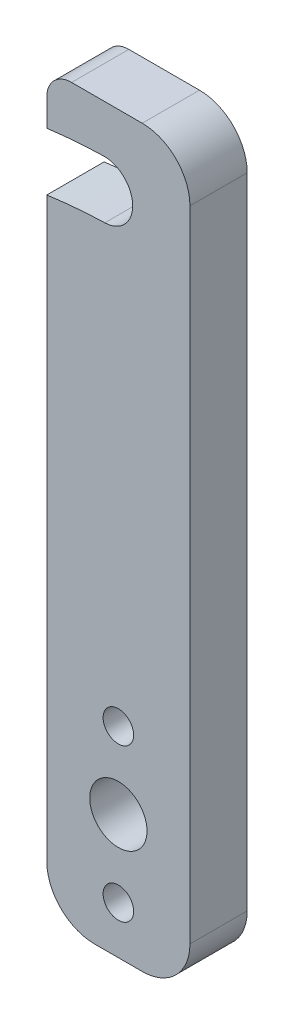
ISO-10303-21;
HEADER;
FILE_DESCRIPTION(('STEP AP214'),'2;1');
FILE_NAME('part.step','',(''),(''),'','','');
FILE_SCHEMA(('AUTOMOTIVE_DESIGN { 1 0 10303 214 1 1 1 1 }'));
ENDSEC;
DATA;
#1=APPLICATION_CONTEXT('core data for automotive mechanical design processes');
#2=APPLICATION_PROTOCOL_DEFINITION('international standard','automotive_design',2000,#1);
#3=PRODUCT_CONTEXT('',#1,'mechanical');
#4=PRODUCT('Part','Part','',(#3));
#5=PRODUCT_RELATED_PRODUCT_CATEGORY('part','',(#4));
#6=PRODUCT_DEFINITION_FORMATION('','',#4);
#7=PRODUCT_DEFINITION_CONTEXT('part definition',#1,'design');
#8=PRODUCT_DEFINITION('design','',#6,#7);
#9=PRODUCT_DEFINITION_SHAPE('','',#8);
#10=(LENGTH_UNIT() NAMED_UNIT(*) SI_UNIT(.MILLI.,.METRE.));
#11=(NAMED_UNIT(*) PLANE_ANGLE_UNIT() SI_UNIT($,.RADIAN.));
#12=(NAMED_UNIT(*) SI_UNIT($,.STERADIAN.) SOLID_ANGLE_UNIT());
#13=UNCERTAINTY_MEASURE_WITH_UNIT(LENGTH_MEASURE(1.E-05),#10,'distance_accuracy_value','');
#14=(GEOMETRIC_REPRESENTATION_CONTEXT(3) GLOBAL_UNCERTAINTY_ASSIGNED_CONTEXT((#13)) GLOBAL_UNIT_ASSIGNED_CONTEXT((#10,
#11,#12)) REPRESENTATION_CONTEXT('',''));
#15=CARTESIAN_POINT('',(0.,0.,0.));
#16=DIRECTION('',(0.,0.,1.));
#17=DIRECTION('',(1.,0.,0.));
#18=AXIS2_PLACEMENT_3D('',#15,#16,#17);
#19=CARTESIAN_POINT('',(-1.49892513753061,30.4905053815204,6.));
#20=DIRECTION('',(0.,0.,-1.));
#21=DIRECTION('',(-1.,0.,0.));
#22=AXIS2_PLACEMENT_3D('',#19,#20,#21);
#23=CYLINDRICAL_SURFACE('',#22,3.);
#24=CARTESIAN_POINT('',(-1.49892513753061,30.4905053815204,0.));
#25=DIRECTION('',(0.,0.,1.));
#26=DIRECTION('',(1.,0.,0.));
#27=AXIS2_PLACEMENT_3D('',#24,#25,#26);
#28=CIRCLE('',#27,3.);
#29=CARTESIAN_POINT('',(-1.41862557659147,27.4915802439898,0.));
#30=VERTEX_POINT('',#29);
#31=CARTESIAN_POINT('',(-1.57922469846975,33.489430519051,0.));
#32=VERTEX_POINT('',#31);
#33=EDGE_CURVE('E135',#30,#32,#28,.T.);
#34=ORIENTED_EDGE('',*,*,#33,.F.);
#35=DIRECTION('',(0.,0.,-1.));
#36=VECTOR('',#35,1.);
#37=CARTESIAN_POINT('',(-1.41862557659147,27.4915802439898,6.));
#38=LINE('',#37,#36);
#39=CARTESIAN_POINT('',(-1.41862557659147,27.4915802439898,6.));
#40=VERTEX_POINT('',#39);
#41=EDGE_CURVE('E129',#40,#30,#38,.T.);
#42=ORIENTED_EDGE('',*,*,#41,.F.);
#43=CARTESIAN_POINT('',(-1.49892513753061,30.4905053815204,6.));
#44=DIRECTION('',(0.,0.,1.));
#45=DIRECTION('',(1.,0.,0.));
#46=AXIS2_PLACEMENT_3D('',#43,#44,#45);
#47=CIRCLE('',#46,3.);
#48=CARTESIAN_POINT('',(-1.57922469846975,33.489430519051,6.));
#49=VERTEX_POINT('',#48);
#50=EDGE_CURVE('E132',#40,#49,#47,.T.);
#51=ORIENTED_EDGE('',*,*,#50,.T.);
#52=DIRECTION('',(0.,0.,-1.));
#53=VECTOR('',#52,1.);
#54=CARTESIAN_POINT('',(-1.57922469846975,33.489430519051,6.));
#55=LINE('',#54,#53);
#56=EDGE_CURVE('E439',#49,#32,#55,.T.);
#57=ORIENTED_EDGE('',*,*,#56,.T.);
#58=EDGE_LOOP('',(#34,#42,#51,#57));
#59=FACE_BOUND('',#58,.T.);
#60=ADVANCED_FACE('F40',(#59),#23,.F.);
#61=CARTESIAN_POINT('',(0.,-25.489430519051,6.));
#62=DIRECTION('',(0.,0.,-1.));
#63=DIRECTION('',(-1.,0.,0.));
#64=AXIS2_PLACEMENT_3D('',#61,#62,#63);
#65=CYLINDRICAL_SURFACE('',#64,53.);
#66=CARTESIAN_POINT('',(0.,-25.489430519051,0.));
#67=DIRECTION('',(0.,0.,1.));
#68=DIRECTION('',(1.,0.,0.));
#69=AXIS2_PLACEMENT_3D('',#66,#67,#68);
#70=CIRCLE('',#69,53.);
#71=CARTESIAN_POINT('',(-7.5,26.977225558881,0.));
#72=VERTEX_POINT('',#71);
#73=EDGE_CURVE('E257',#30,#72,#70,.T.);
#74=ORIENTED_EDGE('',*,*,#73,.T.);
#75=DIRECTION('',(0.,0.,-1.));
#76=VECTOR('',#75,1.);
#77=CARTESIAN_POINT('',(-7.5,26.977225558881,6.));
#78=LINE('',#77,#76);
#79=CARTESIAN_POINT('',(-7.5,26.977225558881,6.));
#80=VERTEX_POINT('',#79);
#81=EDGE_CURVE('E140',#80,#72,#78,.T.);
#82=ORIENTED_EDGE('',*,*,#81,.F.);
#83=CARTESIAN_POINT('',(0.,-25.489430519051,6.));
#84=DIRECTION('',(0.,0.,1.));
#85=DIRECTION('',(1.,0.,0.));
#86=AXIS2_PLACEMENT_3D('',#83,#84,#85);
#87=CIRCLE('',#86,53.);
#88=EDGE_CURVE('E144',#40,#80,#87,.T.);
#89=ORIENTED_EDGE('',*,*,#88,.F.);
#90=ORIENTED_EDGE('',*,*,#41,.T.);
#91=EDGE_LOOP('',(#74,#82,#89,#90));
#92=FACE_BOUND('',#91,.T.);
#93=ADVANCED_FACE('F145',(#92),#65,.T.);
#94=CARTESIAN_POINT('',(-7.5,0.,6.));
#95=DIRECTION('',(-1.,0.,0.));
#96=DIRECTION('',(0.,-1.,0.));
#97=AXIS2_PLACEMENT_3D('',#94,#95,#96);
#98=PLANE('',#97);
#99=DIRECTION('',(0.,1.,0.));
#100=VECTOR('',#99,1.);
#101=CARTESIAN_POINT('',(-7.5,0.,0.));
#102=LINE('',#101,#100);
#103=CARTESIAN_POINT('',(-7.5,-33.489430519051,0.));
#104=VERTEX_POINT('',#103);
#105=EDGE_CURVE('E249',#104,#72,#102,.T.);
#106=ORIENTED_EDGE('',*,*,#105,.F.);
#107=DIRECTION('',(0.,0.,-1.));
#108=VECTOR('',#107,1.);
#109=CARTESIAN_POINT('',(-7.5,-33.489430519051,6.));
#110=LINE('',#109,#108);
#111=CARTESIAN_POINT('',(-7.5,-33.489430519051,6.));
#112=VERTEX_POINT('',#111);
#113=EDGE_CURVE('E215',#104,#112,#110,.F.);
#114=ORIENTED_EDGE('',*,*,#113,.T.);
#115=DIRECTION('',(0.,1.,0.));
#116=VECTOR('',#115,1.);
#117=CARTESIAN_POINT('',(-7.5,0.,6.));
#118=LINE('',#117,#116);
#119=EDGE_CURVE('E150',#112,#80,#118,.T.);
#120=ORIENTED_EDGE('',*,*,#119,.T.);
#121=ORIENTED_EDGE('',*,*,#81,.T.);
#122=EDGE_LOOP('',(#106,#114,#120,#121));
#123=FACE_BOUND('',#122,.T.);
#124=ADVANCED_FACE('F287',(#123),#98,.T.);
#125=CARTESIAN_POINT('',(0.,-38.489430519051,6.));
#126=DIRECTION('',(0.,1.,0.));
#127=DIRECTION('',(0.,0.,1.));
#128=AXIS2_PLACEMENT_3D('',#125,#126,#127);
#129=PLANE('',#128);
#130=DIRECTION('',(1.,0.,0.));
#131=VECTOR('',#130,1.);
#132=CARTESIAN_POINT('',(0.,-38.489430519051,6.));
#133=LINE('',#132,#131);
#134=CARTESIAN_POINT('',(-2.5,-38.489430519051,6.));
#135=VERTEX_POINT('',#134);
#136=CARTESIAN_POINT('',(2.5,-38.489430519051,6.));
#137=VERTEX_POINT('',#136);
#138=EDGE_CURVE('E181',#135,#137,#133,.T.);
#139=ORIENTED_EDGE('',*,*,#138,.F.);
#140=DIRECTION('',(0.,0.,-1.));
#141=VECTOR('',#140,1.);
#142=CARTESIAN_POINT('',(-2.5,-38.489430519051,0.));
#143=LINE('',#142,#141);
#144=CARTESIAN_POINT('',(-2.5,-38.489430519051,0.));
#145=VERTEX_POINT('',#144);
#146=EDGE_CURVE('E433',#135,#145,#143,.T.);
#147=ORIENTED_EDGE('',*,*,#146,.T.);
#148=DIRECTION('',(1.,0.,0.));
#149=VECTOR('',#148,1.);
#150=CARTESIAN_POINT('',(0.,-38.489430519051,0.));
#151=LINE('',#150,#149);
#152=CARTESIAN_POINT('',(2.5,-38.489430519051,0.));
#153=VERTEX_POINT('',#152);
#154=EDGE_CURVE('E256',#145,#153,#151,.T.);
#155=ORIENTED_EDGE('',*,*,#154,.T.);
#156=DIRECTION('',(0.,0.,-1.));
#157=VECTOR('',#156,1.);
#158=CARTESIAN_POINT('',(2.5,-38.489430519051,6.));
#159=LINE('',#158,#157);
#160=EDGE_CURVE('E139',#153,#137,#159,.F.);
#161=ORIENTED_EDGE('',*,*,#160,.T.);
#162=EDGE_LOOP('',(#139,#147,#155,#161));
#163=FACE_BOUND('',#162,.T.);
#164=ADVANCED_FACE('F290',(#163),#129,.F.);
#165=CARTESIAN_POINT('',(7.5,0.,6.));
#166=DIRECTION('',(-1.,0.,0.));
#167=DIRECTION('',(0.,0.,1.));
#168=AXIS2_PLACEMENT_3D('',#165,#166,#167);
#169=PLANE('',#168);
#170=DIRECTION('',(0.,1.,0.));
#171=VECTOR('',#170,1.);
#172=CARTESIAN_POINT('',(7.5,0.,6.));
#173=LINE('',#172,#171);
#174=CARTESIAN_POINT('',(7.5,-33.489430519051,6.));
#175=VERTEX_POINT('',#174);
#176=CARTESIAN_POINT('',(7.5,33.489430519051,6.));
#177=VERTEX_POINT('',#176);
#178=EDGE_CURVE('E193',#175,#177,#173,.T.);
#179=ORIENTED_EDGE('',*,*,#178,.F.);
#180=DIRECTION('',(0.,0.,-1.));
#181=VECTOR('',#180,1.);
#182=CARTESIAN_POINT('',(7.5,-33.489430519051,6.));
#183=LINE('',#182,#181);
#184=CARTESIAN_POINT('',(7.5,-33.489430519051,0.));
#185=VERTEX_POINT('',#184);
#186=EDGE_CURVE('E225',#175,#185,#183,.T.);
#187=ORIENTED_EDGE('',*,*,#186,.T.);
#188=DIRECTION('',(0.,1.,0.));
#189=VECTOR('',#188,1.);
#190=CARTESIAN_POINT('',(7.5,0.,0.));
#191=LINE('',#190,#189);
#192=CARTESIAN_POINT('',(7.5,33.489430519051,0.));
#193=VERTEX_POINT('',#192);
#194=EDGE_CURVE('E252',#185,#193,#191,.T.);
#195=ORIENTED_EDGE('',*,*,#194,.T.);
#196=DIRECTION('',(0.,0.,-1.));
#197=VECTOR('',#196,1.);
#198=CARTESIAN_POINT('',(7.5,33.489430519051,6.));
#199=LINE('',#198,#197);
#200=EDGE_CURVE('E223',#193,#177,#199,.F.);
#201=ORIENTED_EDGE('',*,*,#200,.T.);
#202=EDGE_LOOP('',(#179,#187,#195,#201));
#203=FACE_BOUND('',#202,.T.);
#204=ADVANCED_FACE('F293',(#203),#169,.F.);
#205=CARTESIAN_POINT('',(0.,38.489430519051,6.));
#206=DIRECTION('',(0.,1.,0.));
#207=DIRECTION('',(0.,0.,1.));
#208=AXIS2_PLACEMENT_3D('',#205,#206,#207);
#209=PLANE('',#208);
#210=DIRECTION('',(1.,0.,0.));
#211=VECTOR('',#210,1.);
#212=CARTESIAN_POINT('',(0.,38.489430519051,0.));
#213=LINE('',#212,#211);
#214=CARTESIAN_POINT('',(-4.9,38.489430519051,0.));
#215=VERTEX_POINT('',#214);
#216=CARTESIAN_POINT('',(2.5,38.489430519051,0.));
#217=VERTEX_POINT('',#216);
#218=EDGE_CURVE('E247',#215,#217,#213,.T.);
#219=ORIENTED_EDGE('',*,*,#218,.F.);
#220=DIRECTION('',(0.,0.,-1.));
#221=VECTOR('',#220,1.);
#222=CARTESIAN_POINT('',(-4.9,38.489430519051,6.));
#223=LINE('',#222,#221);
#224=CARTESIAN_POINT('',(-4.9,38.489430519051,6.));
#225=VERTEX_POINT('',#224);
#226=EDGE_CURVE('E50',#215,#225,#223,.F.);
#227=ORIENTED_EDGE('',*,*,#226,.T.);
#228=DIRECTION('',(1.,0.,0.));
#229=VECTOR('',#228,1.);
#230=CARTESIAN_POINT('',(0.,38.489430519051,6.));
#231=LINE('',#230,#229);
#232=CARTESIAN_POINT('',(2.5,38.489430519051,6.));
#233=VERTEX_POINT('',#232);
#234=EDGE_CURVE('E190',#225,#233,#231,.T.);
#235=ORIENTED_EDGE('',*,*,#234,.T.);
#236=DIRECTION('',(0.,0.,-1.));
#237=VECTOR('',#236,1.);
#238=CARTESIAN_POINT('',(2.5,38.489430519051,0.));
#239=LINE('',#238,#237);
#240=EDGE_CURVE('E228',#233,#217,#239,.T.);
#241=ORIENTED_EDGE('',*,*,#240,.T.);
#242=EDGE_LOOP('',(#219,#227,#235,#241));
#243=FACE_BOUND('',#242,.T.);
#244=ADVANCED_FACE('F297',(#243),#209,.T.);
#245=CARTESIAN_POINT('',(-7.5,33.0319331014253,6.));
#246=VERTEX_POINT('',#245);
#247=CARTESIAN_POINT('',(-7.5,35.889430519051,6.));
#248=VERTEX_POINT('',#247);
#249=EDGE_CURVE('E182',#246,#248,#118,.T.);
#250=ORIENTED_EDGE('',*,*,#249,.T.);
#251=DIRECTION('',(0.,0.,-1.));
#252=VECTOR('',#251,1.);
#253=CARTESIAN_POINT('',(-7.5,35.889430519051,6.));
#254=LINE('',#253,#252);
#255=CARTESIAN_POINT('',(-7.5,35.889430519051,0.));
#256=VERTEX_POINT('',#255);
#257=EDGE_CURVE('E231',#248,#256,#254,.T.);
#258=ORIENTED_EDGE('',*,*,#257,.T.);
#259=CARTESIAN_POINT('',(-7.5,33.0319331014253,0.));
#260=VERTEX_POINT('',#259);
#261=EDGE_CURVE('E239',#260,#256,#102,.T.);
#262=ORIENTED_EDGE('',*,*,#261,.F.);
#263=DIRECTION('',(0.,0.,-1.));
#264=VECTOR('',#263,1.);
#265=CARTESIAN_POINT('',(-7.5,33.0319331014253,6.));
#266=LINE('',#265,#264);
#267=EDGE_CURVE('E437',#246,#260,#266,.T.);
#268=ORIENTED_EDGE('',*,*,#267,.F.);
#269=EDGE_LOOP('',(#250,#258,#262,#268));
#270=FACE_BOUND('',#269,.T.);
#271=ADVANCED_FACE('F238',(#270),#98,.T.);
#272=CARTESIAN_POINT('',(0.,-17.489430519051,6.));
#273=DIRECTION('',(0.,0.,-1.));
#274=DIRECTION('',(-1.,0.,0.));
#275=AXIS2_PLACEMENT_3D('',#272,#273,#274);
#276=CYLINDRICAL_SURFACE('',#275,1.6);
#277=CARTESIAN_POINT('',(0.,-17.489430519051,6.));
#278=DIRECTION('',(0.,0.,1.));
#279=DIRECTION('',(1.,0.,0.));
#280=AXIS2_PLACEMENT_3D('',#277,#278,#279);
#281=CIRCLE('',#280,1.6);
#282=CARTESIAN_POINT('',(1.6,-17.489430519051,6.));
#283=VERTEX_POINT('',#282);
#284=EDGE_CURVE('E197',#283,#283,#281,.T.);
#285=ORIENTED_EDGE('',*,*,#284,.T.);
#286=EDGE_LOOP('',(#285));
#287=FACE_BOUND('',#286,.T.);
#288=CARTESIAN_POINT('',(0.,-17.489430519051,0.));
#289=DIRECTION('',(0.,0.,1.));
#290=DIRECTION('',(1.,0.,0.));
#291=AXIS2_PLACEMENT_3D('',#288,#289,#290);
#292=CIRCLE('',#291,1.6);
#293=CARTESIAN_POINT('',(1.6,-17.489430519051,0.));
#294=VERTEX_POINT('',#293);
#295=EDGE_CURVE('E250',#294,#294,#292,.T.);
#296=ORIENTED_EDGE('',*,*,#295,.F.);
#297=EDGE_LOOP('',(#296));
#298=FACE_BOUND('',#297,.T.);
#299=ADVANCED_FACE('F278',(#287,#298),#276,.F.);
#300=CARTESIAN_POINT('',(0.,-25.489430519051,6.));
#301=DIRECTION('',(0.,0.,-1.));
#302=DIRECTION('',(-1.,0.,0.));
#303=AXIS2_PLACEMENT_3D('',#300,#301,#302);
#304=CYLINDRICAL_SURFACE('',#303,59.);
#305=CARTESIAN_POINT('',(0.,-25.489430519051,0.));
#306=DIRECTION('',(0.,0.,1.));
#307=DIRECTION('',(1.,0.,0.));
#308=AXIS2_PLACEMENT_3D('',#305,#306,#307);
#309=CIRCLE('',#308,59.);
#310=EDGE_CURVE('E246',#32,#260,#309,.T.);
#311=ORIENTED_EDGE('',*,*,#310,.F.);
#312=ORIENTED_EDGE('',*,*,#56,.F.);
#313=CARTESIAN_POINT('',(0.,-25.489430519051,6.));
#314=DIRECTION('',(0.,0.,1.));
#315=DIRECTION('',(1.,0.,0.));
#316=AXIS2_PLACEMENT_3D('',#313,#314,#315);
#317=CIRCLE('',#316,59.);
#318=EDGE_CURVE('E156',#49,#246,#317,.T.);
#319=ORIENTED_EDGE('',*,*,#318,.T.);
#320=ORIENTED_EDGE('',*,*,#267,.T.);
#321=EDGE_LOOP('',(#311,#312,#319,#320));
#322=FACE_BOUND('',#321,.T.);
#323=ADVANCED_FACE('F269',(#322),#304,.F.);
#324=CARTESIAN_POINT('',(0.,-25.489430519051,6.));
#325=DIRECTION('',(0.,0.,-1.));
#326=DIRECTION('',(-1.,0.,0.));
#327=AXIS2_PLACEMENT_3D('',#324,#325,#326);
#328=CYLINDRICAL_SURFACE('',#327,3.);
#329=CARTESIAN_POINT('',(0.,-25.489430519051,6.));
#330=DIRECTION('',(0.,0.,1.));
#331=DIRECTION('',(1.,0.,0.));
#332=AXIS2_PLACEMENT_3D('',#329,#330,#331);
#333=CIRCLE('',#332,3.);
#334=CARTESIAN_POINT('',(3.,-25.489430519051,6.));
#335=VERTEX_POINT('',#334);
#336=EDGE_CURVE('E158',#335,#335,#333,.T.);
#337=ORIENTED_EDGE('',*,*,#336,.T.);
#338=EDGE_LOOP('',(#337));
#339=FACE_BOUND('',#338,.T.);
#340=CARTESIAN_POINT('',(0.,-25.489430519051,0.));
#341=DIRECTION('',(0.,0.,1.));
#342=DIRECTION('',(1.,0.,0.));
#343=AXIS2_PLACEMENT_3D('',#340,#341,#342);
#344=CIRCLE('',#343,3.);
#345=CARTESIAN_POINT('',(3.,-25.489430519051,0.));
#346=VERTEX_POINT('',#345);
#347=EDGE_CURVE('E260',#346,#346,#344,.T.);
#348=ORIENTED_EDGE('',*,*,#347,.F.);
#349=EDGE_LOOP('',(#348));
#350=FACE_BOUND('',#349,.T.);
#351=ADVANCED_FACE('F266',(#339,#350),#328,.F.);
#352=CARTESIAN_POINT('',(0.,-33.489430519051,6.));
#353=DIRECTION('',(0.,0.,-1.));
#354=DIRECTION('',(-1.,0.,0.));
#355=AXIS2_PLACEMENT_3D('',#352,#353,#354);
#356=CYLINDRICAL_SURFACE('',#355,1.6);
#357=CARTESIAN_POINT('',(0.,-33.489430519051,6.));
#358=DIRECTION('',(0.,0.,1.));
#359=DIRECTION('',(1.,0.,0.));
#360=AXIS2_PLACEMENT_3D('',#357,#358,#359);
#361=CIRCLE('',#360,1.6);
#362=CARTESIAN_POINT('',(1.6,-33.489430519051,6.));
#363=VERTEX_POINT('',#362);
#364=EDGE_CURVE('E201',#363,#363,#361,.T.);
#365=ORIENTED_EDGE('',*,*,#364,.T.);
#366=EDGE_LOOP('',(#365));
#367=FACE_BOUND('',#366,.T.);
#368=CARTESIAN_POINT('',(0.,-33.489430519051,0.));
#369=DIRECTION('',(0.,0.,1.));
#370=DIRECTION('',(1.,0.,0.));
#371=AXIS2_PLACEMENT_3D('',#368,#369,#370);
#372=CIRCLE('',#371,1.6);
#373=CARTESIAN_POINT('',(1.6,-33.489430519051,0.));
#374=VERTEX_POINT('',#373);
#375=EDGE_CURVE('E163',#374,#374,#372,.T.);
#376=ORIENTED_EDGE('',*,*,#375,.F.);
#377=EDGE_LOOP('',(#376));
#378=FACE_BOUND('',#377,.T.);
#379=ADVANCED_FACE('F268',(#367,#378),#356,.F.);
#380=CARTESIAN_POINT('',(0.,0.,6.));
#381=DIRECTION('',(0.,0.,1.));
#382=DIRECTION('',(1.,0.,0.));
#383=AXIS2_PLACEMENT_3D('',#380,#381,#382);
#384=PLANE('',#383);
#385=ORIENTED_EDGE('',*,*,#336,.F.);
#386=EDGE_LOOP('',(#385));
#387=FACE_BOUND('',#386,.T.);
#388=ORIENTED_EDGE('',*,*,#234,.F.);
#389=CARTESIAN_POINT('',(-4.9,35.889430519051,6.));
#390=DIRECTION('',(0.,0.,1.));
#391=DIRECTION('',(1.,0.,0.));
#392=AXIS2_PLACEMENT_3D('',#389,#390,#391);
#393=CIRCLE('',#392,2.6);
#394=EDGE_CURVE('E12',#225,#248,#393,.T.);
#395=ORIENTED_EDGE('',*,*,#394,.T.);
#396=ORIENTED_EDGE('',*,*,#249,.F.);
#397=ORIENTED_EDGE('',*,*,#318,.F.);
#398=ORIENTED_EDGE('',*,*,#50,.F.);
#399=ORIENTED_EDGE('',*,*,#88,.T.);
#400=ORIENTED_EDGE('',*,*,#119,.F.);
#401=CARTESIAN_POINT('',(-2.5,-33.489430519051,6.));
#402=DIRECTION('',(0.,0.,1.));
#403=DIRECTION('',(1.,0.,0.));
#404=AXIS2_PLACEMENT_3D('',#401,#402,#403);
#405=CIRCLE('',#404,5.);
#406=EDGE_CURVE('E219',#112,#135,#405,.T.);
#407=ORIENTED_EDGE('',*,*,#406,.T.);
#408=ORIENTED_EDGE('',*,*,#138,.T.);
#409=CARTESIAN_POINT('',(2.5,-33.489430519051,6.));
#410=DIRECTION('',(0.,0.,1.));
#411=DIRECTION('',(1.,0.,0.));
#412=AXIS2_PLACEMENT_3D('',#409,#410,#411);
#413=CIRCLE('',#412,5.);
#414=EDGE_CURVE('E214',#137,#175,#413,.T.);
#415=ORIENTED_EDGE('',*,*,#414,.T.);
#416=ORIENTED_EDGE('',*,*,#178,.T.);
#417=CARTESIAN_POINT('',(2.5,33.489430519051,6.));
#418=DIRECTION('',(0.,0.,1.));
#419=DIRECTION('',(1.,0.,0.));
#420=AXIS2_PLACEMENT_3D('',#417,#418,#419);
#421=CIRCLE('',#420,5.);
#422=EDGE_CURVE('E208',#177,#233,#421,.T.);
#423=ORIENTED_EDGE('',*,*,#422,.T.);
#424=EDGE_LOOP('',(#388,#395,#396,#397,#398,#399,#400,#407,#408,#415,#416,#423));
#425=FACE_BOUND('',#424,.T.);
#426=ORIENTED_EDGE('',*,*,#284,.F.);
#427=EDGE_LOOP('',(#426));
#428=FACE_BOUND('',#427,.T.);
#429=ORIENTED_EDGE('',*,*,#364,.F.);
#430=EDGE_LOOP('',(#429));
#431=FACE_BOUND('',#430,.T.);
#432=ADVANCED_FACE('F152',(#387,#425,#428,#431),#384,.T.);
#433=CARTESIAN_POINT('',(0.,0.,0.));
#434=DIRECTION('',(0.,0.,1.));
#435=DIRECTION('',(1.,0.,0.));
#436=AXIS2_PLACEMENT_3D('',#433,#434,#435);
#437=PLANE('',#436);
#438=ORIENTED_EDGE('',*,*,#347,.T.);
#439=EDGE_LOOP('',(#438));
#440=FACE_BOUND('',#439,.T.);
#441=ORIENTED_EDGE('',*,*,#261,.T.);
#442=CARTESIAN_POINT('',(-4.9,35.889430519051,0.));
#443=DIRECTION('',(0.,0.,1.));
#444=DIRECTION('',(1.,0.,0.));
#445=AXIS2_PLACEMENT_3D('',#442,#443,#444);
#446=CIRCLE('',#445,2.6);
#447=EDGE_CURVE('E64',#256,#215,#446,.F.);
#448=ORIENTED_EDGE('',*,*,#447,.T.);
#449=ORIENTED_EDGE('',*,*,#218,.T.);
#450=CARTESIAN_POINT('',(2.5,33.489430519051,0.));
#451=DIRECTION('',(0.,0.,1.));
#452=DIRECTION('',(1.,0.,0.));
#453=AXIS2_PLACEMENT_3D('',#450,#451,#452);
#454=CIRCLE('',#453,5.);
#455=EDGE_CURVE('E429',#217,#193,#454,.F.);
#456=ORIENTED_EDGE('',*,*,#455,.T.);
#457=ORIENTED_EDGE('',*,*,#194,.F.);
#458=CARTESIAN_POINT('',(2.5,-33.489430519051,0.));
#459=DIRECTION('',(0.,0.,1.));
#460=DIRECTION('',(1.,0.,0.));
#461=AXIS2_PLACEMENT_3D('',#458,#459,#460);
#462=CIRCLE('',#461,5.);
#463=EDGE_CURVE('E427',#185,#153,#462,.F.);
#464=ORIENTED_EDGE('',*,*,#463,.T.);
#465=ORIENTED_EDGE('',*,*,#154,.F.);
#466=CARTESIAN_POINT('',(-2.5,-33.489430519051,0.));
#467=DIRECTION('',(0.,0.,1.));
#468=DIRECTION('',(1.,0.,0.));
#469=AXIS2_PLACEMENT_3D('',#466,#467,#468);
#470=CIRCLE('',#469,5.);
#471=EDGE_CURVE('E425',#145,#104,#470,.F.);
#472=ORIENTED_EDGE('',*,*,#471,.T.);
#473=ORIENTED_EDGE('',*,*,#105,.T.);
#474=ORIENTED_EDGE('',*,*,#73,.F.);
#475=ORIENTED_EDGE('',*,*,#33,.T.);
#476=ORIENTED_EDGE('',*,*,#310,.T.);
#477=EDGE_LOOP('',(#441,#448,#449,#456,#457,#464,#465,#472,#473,#474,#475,#476));
#478=FACE_BOUND('',#477,.T.);
#479=ORIENTED_EDGE('',*,*,#295,.T.);
#480=EDGE_LOOP('',(#479));
#481=FACE_BOUND('',#480,.T.);
#482=ORIENTED_EDGE('',*,*,#375,.T.);
#483=EDGE_LOOP('',(#482));
#484=FACE_BOUND('',#483,.T.);
#485=ADVANCED_FACE('F243',(#440,#478,#481,#484),#437,.F.);
#486=CARTESIAN_POINT('',(-2.5,-33.489430519051,6.));
#487=DIRECTION('',(0.,0.,1.));
#488=DIRECTION('',(1.,0.,0.));
#489=AXIS2_PLACEMENT_3D('',#486,#487,#488);
#490=CYLINDRICAL_SURFACE('',#489,5.);
#491=ORIENTED_EDGE('',*,*,#406,.F.);
#492=ORIENTED_EDGE('',*,*,#113,.F.);
#493=ORIENTED_EDGE('',*,*,#471,.F.);
#494=ORIENTED_EDGE('',*,*,#146,.F.);
#495=EDGE_LOOP('',(#491,#492,#493,#494));
#496=FACE_BOUND('',#495,.T.);
#497=ADVANCED_FACE('F308',(#496),#490,.T.);
#498=CARTESIAN_POINT('',(2.5,-33.489430519051,6.));
#499=DIRECTION('',(0.,0.,-1.));
#500=DIRECTION('',(-1.,0.,0.));
#501=AXIS2_PLACEMENT_3D('',#498,#499,#500);
#502=CYLINDRICAL_SURFACE('',#501,5.);
#503=ORIENTED_EDGE('',*,*,#414,.F.);
#504=ORIENTED_EDGE('',*,*,#160,.F.);
#505=ORIENTED_EDGE('',*,*,#463,.F.);
#506=ORIENTED_EDGE('',*,*,#186,.F.);
#507=EDGE_LOOP('',(#503,#504,#505,#506));
#508=FACE_BOUND('',#507,.T.);
#509=ADVANCED_FACE('F328',(#508),#502,.T.);
#510=CARTESIAN_POINT('',(2.5,33.489430519051,6.));
#511=DIRECTION('',(0.,0.,1.));
#512=DIRECTION('',(1.,0.,0.));
#513=AXIS2_PLACEMENT_3D('',#510,#511,#512);
#514=CYLINDRICAL_SURFACE('',#513,5.);
#515=ORIENTED_EDGE('',*,*,#422,.F.);
#516=ORIENTED_EDGE('',*,*,#200,.F.);
#517=ORIENTED_EDGE('',*,*,#455,.F.);
#518=ORIENTED_EDGE('',*,*,#240,.F.);
#519=EDGE_LOOP('',(#515,#516,#517,#518));
#520=FACE_BOUND('',#519,.T.);
#521=ADVANCED_FACE('F336',(#520),#514,.T.);
#522=CARTESIAN_POINT('',(-4.9,35.889430519051,6.));
#523=DIRECTION('',(0.,0.,-1.));
#524=DIRECTION('',(-1.,0.,0.));
#525=AXIS2_PLACEMENT_3D('',#522,#523,#524);
#526=CYLINDRICAL_SURFACE('',#525,2.6);
#527=ORIENTED_EDGE('',*,*,#394,.F.);
#528=ORIENTED_EDGE('',*,*,#226,.F.);
#529=ORIENTED_EDGE('',*,*,#447,.F.);
#530=ORIENTED_EDGE('',*,*,#257,.F.);
#531=EDGE_LOOP('',(#527,#528,#529,#530));
#532=FACE_BOUND('',#531,.T.);
#533=ADVANCED_FACE('F42',(#532),#526,.T.);
#534=CLOSED_SHELL('',(#60,#93,#124,#164,#204,#244,#271,#299,#323,#351,#379,#432,#485,#497,#509,
#521,#533));
#535=MANIFOLD_SOLID_BREP('B2',#534);
#536=ADVANCED_BREP_SHAPE_REPRESENTATION('',(#18,#535),#14);
#537=SHAPE_DEFINITION_REPRESENTATION(#9,#536);
ENDSEC;
END-ISO-10303-21;
